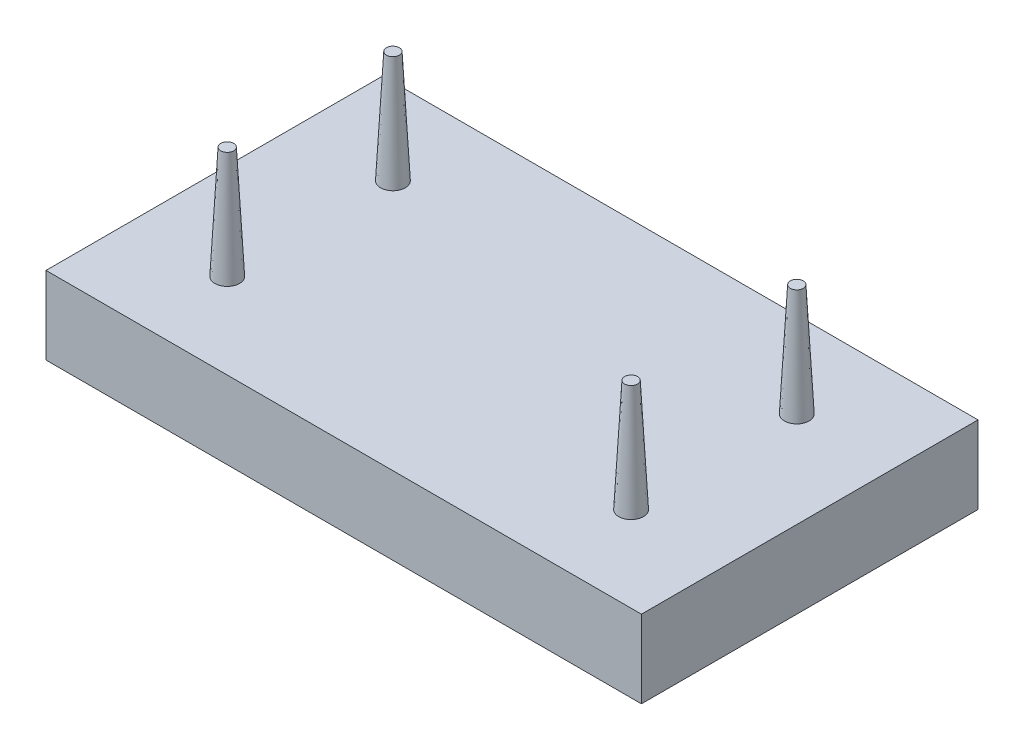
ISO-10303-21;
HEADER;
FILE_DESCRIPTION(('STEP AP214'),'2;1');
FILE_NAME('part.step','',(''),(''),'','','');
FILE_SCHEMA(('AUTOMOTIVE_DESIGN { 1 0 10303 214 1 1 1 1 }'));
ENDSEC;
DATA;
#1=APPLICATION_CONTEXT('core data for automotive mechanical design processes');
#2=APPLICATION_PROTOCOL_DEFINITION('international standard','automotive_design',2000,#1);
#3=PRODUCT_CONTEXT('',#1,'mechanical');
#4=PRODUCT('Part','Part','',(#3));
#5=PRODUCT_RELATED_PRODUCT_CATEGORY('part','',(#4));
#6=PRODUCT_DEFINITION_FORMATION('','',#4);
#7=PRODUCT_DEFINITION_CONTEXT('part definition',#1,'design');
#8=PRODUCT_DEFINITION('design','',#6,#7);
#9=PRODUCT_DEFINITION_SHAPE('','',#8);
#10=(LENGTH_UNIT() NAMED_UNIT(*) SI_UNIT(.MILLI.,.METRE.));
#11=(NAMED_UNIT(*) PLANE_ANGLE_UNIT() SI_UNIT($,.RADIAN.));
#12=(NAMED_UNIT(*) SI_UNIT($,.STERADIAN.) SOLID_ANGLE_UNIT());
#13=UNCERTAINTY_MEASURE_WITH_UNIT(LENGTH_MEASURE(1.E-05),#10,'distance_accuracy_value','');
#14=(GEOMETRIC_REPRESENTATION_CONTEXT(3) GLOBAL_UNCERTAINTY_ASSIGNED_CONTEXT((#13)) GLOBAL_UNIT_ASSIGNED_CONTEXT((#10,
#11,#12)) REPRESENTATION_CONTEXT('',''));
#15=CARTESIAN_POINT('',(0.,0.,0.));
#16=DIRECTION('',(0.,0.,1.));
#17=DIRECTION('',(1.,0.,0.));
#18=AXIS2_PLACEMENT_3D('',#15,#16,#17);
#19=CARTESIAN_POINT('',(0.,-30.,0.));
#20=DIRECTION('',(0.,1.,0.));
#21=DIRECTION('',(0.,0.,1.));
#22=AXIS2_PLACEMENT_3D('',#19,#20,#21);
#23=PLANE('',#22);
#24=DIRECTION('',(0.,0.,-1.));
#25=VECTOR('',#24,1.);
#26=CARTESIAN_POINT('',(-115.,-30.,65.));
#27=LINE('',#26,#25);
#28=CARTESIAN_POINT('',(-115.,-30.,65.));
#29=VERTEX_POINT('',#28);
#30=CARTESIAN_POINT('',(-115.,-30.,-65.));
#31=VERTEX_POINT('',#30);
#32=EDGE_CURVE('E78',#29,#31,#27,.T.);
#33=ORIENTED_EDGE('',*,*,#32,.T.);
#34=DIRECTION('',(1.,0.,0.));
#35=VECTOR('',#34,1.);
#36=CARTESIAN_POINT('',(115.,-30.,-65.));
#37=LINE('',#36,#35);
#38=CARTESIAN_POINT('',(115.,-30.,-65.));
#39=VERTEX_POINT('',#38);
#40=EDGE_CURVE('E86',#31,#39,#37,.T.);
#41=ORIENTED_EDGE('',*,*,#40,.T.);
#42=DIRECTION('',(0.,0.,1.));
#43=VECTOR('',#42,1.);
#44=CARTESIAN_POINT('',(115.,-30.,65.));
#45=LINE('',#44,#43);
#46=CARTESIAN_POINT('',(115.,-30.,65.));
#47=VERTEX_POINT('',#46);
#48=EDGE_CURVE('E92',#39,#47,#45,.T.);
#49=ORIENTED_EDGE('',*,*,#48,.T.);
#50=DIRECTION('',(-1.,0.,0.));
#51=VECTOR('',#50,1.);
#52=CARTESIAN_POINT('',(115.,-30.,65.));
#53=LINE('',#52,#51);
#54=EDGE_CURVE('E84',#47,#29,#53,.T.);
#55=ORIENTED_EDGE('',*,*,#54,.T.);
#56=EDGE_LOOP('',(#33,#41,#49,#55));
#57=FACE_BOUND('',#56,.T.);
#58=ADVANCED_FACE('F34',(#57),#23,.F.);
#59=CARTESIAN_POINT('',(115.,85.,-65.));
#60=DIRECTION('',(0.,0.,-1.));
#61=DIRECTION('',(-1.,0.,0.));
#62=AXIS2_PLACEMENT_3D('',#59,#60,#61);
#63=PLANE('',#62);
#64=DIRECTION('',(0.,-1.,0.));
#65=VECTOR('',#64,1.);
#66=CARTESIAN_POINT('',(-115.,85.,-65.));
#67=LINE('',#66,#65);
#68=CARTESIAN_POINT('',(-115.,0.,-65.));
#69=VERTEX_POINT('',#68);
#70=EDGE_CURVE('E74',#69,#31,#67,.T.);
#71=ORIENTED_EDGE('',*,*,#70,.F.);
#72=DIRECTION('',(1.,0.,0.));
#73=VECTOR('',#72,1.);
#74=CARTESIAN_POINT('',(115.,0.,-65.));
#75=LINE('',#74,#73);
#76=CARTESIAN_POINT('',(115.,0.,-65.));
#77=VERTEX_POINT('',#76);
#78=EDGE_CURVE('E38',#69,#77,#75,.T.);
#79=ORIENTED_EDGE('',*,*,#78,.T.);
#80=DIRECTION('',(0.,-1.,0.));
#81=VECTOR('',#80,1.);
#82=CARTESIAN_POINT('',(115.,85.,-65.));
#83=LINE('',#82,#81);
#84=EDGE_CURVE('E83',#77,#39,#83,.T.);
#85=ORIENTED_EDGE('',*,*,#84,.T.);
#86=ORIENTED_EDGE('',*,*,#40,.F.);
#87=EDGE_LOOP('',(#71,#79,#85,#86));
#88=FACE_BOUND('',#87,.T.);
#89=ADVANCED_FACE('F87',(#88),#63,.T.);
#90=CARTESIAN_POINT('',(115.,85.,65.));
#91=DIRECTION('',(1.,0.,0.));
#92=DIRECTION('',(0.,0.,-1.));
#93=AXIS2_PLACEMENT_3D('',#90,#91,#92);
#94=PLANE('',#93);
#95=ORIENTED_EDGE('',*,*,#84,.F.);
#96=DIRECTION('',(0.,0.,1.));
#97=VECTOR('',#96,1.);
#98=CARTESIAN_POINT('',(115.,0.,65.));
#99=LINE('',#98,#97);
#100=CARTESIAN_POINT('',(115.,0.,65.));
#101=VERTEX_POINT('',#100);
#102=EDGE_CURVE('E108',#77,#101,#99,.T.);
#103=ORIENTED_EDGE('',*,*,#102,.T.);
#104=DIRECTION('',(0.,-1.,0.));
#105=VECTOR('',#104,1.);
#106=CARTESIAN_POINT('',(115.,85.,65.));
#107=LINE('',#106,#105);
#108=EDGE_CURVE('E103',#101,#47,#107,.T.);
#109=ORIENTED_EDGE('',*,*,#108,.T.);
#110=ORIENTED_EDGE('',*,*,#48,.F.);
#111=EDGE_LOOP('',(#95,#103,#109,#110));
#112=FACE_BOUND('',#111,.T.);
#113=ADVANCED_FACE('F107',(#112),#94,.T.);
#114=CARTESIAN_POINT('',(115.,85.,65.));
#115=DIRECTION('',(0.,0.,1.));
#116=DIRECTION('',(1.,0.,0.));
#117=AXIS2_PLACEMENT_3D('',#114,#115,#116);
#118=PLANE('',#117);
#119=ORIENTED_EDGE('',*,*,#108,.F.);
#120=DIRECTION('',(-1.,0.,0.));
#121=VECTOR('',#120,1.);
#122=CARTESIAN_POINT('',(115.,0.,65.));
#123=LINE('',#122,#121);
#124=CARTESIAN_POINT('',(-115.,0.,65.));
#125=VERTEX_POINT('',#124);
#126=EDGE_CURVE('E51',#101,#125,#123,.T.);
#127=ORIENTED_EDGE('',*,*,#126,.T.);
#128=DIRECTION('',(0.,-1.,0.));
#129=VECTOR('',#128,1.);
#130=CARTESIAN_POINT('',(-115.,85.,65.));
#131=LINE('',#130,#129);
#132=EDGE_CURVE('E101',#125,#29,#131,.T.);
#133=ORIENTED_EDGE('',*,*,#132,.T.);
#134=ORIENTED_EDGE('',*,*,#54,.F.);
#135=EDGE_LOOP('',(#119,#127,#133,#134));
#136=FACE_BOUND('',#135,.T.);
#137=ADVANCED_FACE('F110',(#136),#118,.T.);
#138=CARTESIAN_POINT('',(-115.,85.,65.));
#139=DIRECTION('',(-1.,0.,0.));
#140=DIRECTION('',(0.,0.,1.));
#141=AXIS2_PLACEMENT_3D('',#138,#139,#140);
#142=PLANE('',#141);
#143=ORIENTED_EDGE('',*,*,#132,.F.);
#144=DIRECTION('',(0.,0.,-1.));
#145=VECTOR('',#144,1.);
#146=CARTESIAN_POINT('',(-115.,0.,65.));
#147=LINE('',#146,#145);
#148=EDGE_CURVE('E80',#125,#69,#147,.T.);
#149=ORIENTED_EDGE('',*,*,#148,.T.);
#150=ORIENTED_EDGE('',*,*,#70,.T.);
#151=ORIENTED_EDGE('',*,*,#32,.F.);
#152=EDGE_LOOP('',(#143,#149,#150,#151));
#153=FACE_BOUND('',#152,.T.);
#154=ADVANCED_FACE('F36',(#153),#142,.T.);
#155=CARTESIAN_POINT('',(0.,43.246,0.));
#156=DIRECTION('',(0.,-1.,0.));
#157=DIRECTION('',(0.,0.,-1.));
#158=AXIS2_PLACEMENT_3D('',#155,#156,#157);
#159=PLANE('',#158);
#160=CARTESIAN_POINT('',(-78.,43.246,-32.));
#161=DIRECTION('',(0.,-1.,0.));
#162=DIRECTION('',(-0.948683298050514,0.,0.316227766016838));
#163=AXIS2_PLACEMENT_3D('',#160,#161,#162);
#164=CIRCLE('',#163,2.5);
#165=CARTESIAN_POINT('',(-80.3717082451263,43.246,-31.2094305849579));
#166=VERTEX_POINT('',#165);
#167=EDGE_CURVE('E111',#166,#166,#164,.T.);
#168=ORIENTED_EDGE('',*,*,#167,.F.);
#169=EDGE_LOOP('',(#168));
#170=FACE_BOUND('',#169,.T.);
#171=ADVANCED_FACE('F149',(#170),#159,.F.);
#172=CARTESIAN_POINT('',(-78.,43.246,-32.));
#173=DIRECTION('',(0.,-1.,0.));
#174=DIRECTION('',(-0.948683298050514,0.,0.316227766016838));
#175=AXIS2_PLACEMENT_3D('',#172,#173,#174);
#176=CONICAL_SURFACE('',#175,2.5,0.05235987755983);
#177=ORIENTED_EDGE('',*,*,#167,.T.);
#178=EDGE_LOOP('',(#177));
#179=FACE_BOUND('',#178,.T.);
#180=CARTESIAN_POINT('',(-78.,0.,-32.));
#181=DIRECTION('',(0.,1.,0.));
#182=DIRECTION('',(0.,0.,1.));
#183=AXIS2_PLACEMENT_3D('',#180,#181,#182);
#184=CIRCLE('',#183,4.76642682287441);
#185=CARTESIAN_POINT('',(-78.,0.,-27.2335731771256));
#186=VERTEX_POINT('',#185);
#187=EDGE_CURVE('E116',#186,#186,#184,.T.);
#188=ORIENTED_EDGE('',*,*,#187,.T.);
#189=EDGE_LOOP('',(#188));
#190=FACE_BOUND('',#189,.T.);
#191=ADVANCED_FACE('F146',(#179,#190),#176,.T.);
#192=CARTESIAN_POINT('',(78.,43.246,-32.));
#193=DIRECTION('',(0.,1.,0.));
#194=DIRECTION('',(0.948683298050514,0.,-0.316227766016838));
#195=AXIS2_PLACEMENT_3D('',#192,#193,#194);
#196=PLANE('',#195);
#197=CARTESIAN_POINT('',(78.,43.246,-32.));
#198=DIRECTION('',(0.,-1.,0.));
#199=DIRECTION('',(-0.948683298050514,0.,0.316227766016838));
#200=AXIS2_PLACEMENT_3D('',#197,#198,#199);
#201=CIRCLE('',#200,2.5);
#202=CARTESIAN_POINT('',(75.6282917548737,43.246,-31.2094305849579));
#203=VERTEX_POINT('',#202);
#204=EDGE_CURVE('E117',#203,#203,#201,.T.);
#205=ORIENTED_EDGE('',*,*,#204,.F.);
#206=EDGE_LOOP('',(#205));
#207=FACE_BOUND('',#206,.T.);
#208=ADVANCED_FACE('F148',(#207),#196,.T.);
#209=CARTESIAN_POINT('',(78.,43.246,-32.));
#210=DIRECTION('',(0.,-1.,0.));
#211=DIRECTION('',(-0.948683298050514,0.,0.316227766016838));
#212=AXIS2_PLACEMENT_3D('',#209,#210,#211);
#213=CONICAL_SURFACE('',#212,2.5,0.05235987755983);
#214=ORIENTED_EDGE('',*,*,#204,.T.);
#215=EDGE_LOOP('',(#214));
#216=FACE_BOUND('',#215,.T.);
#217=CARTESIAN_POINT('',(78.,0.,-32.));
#218=DIRECTION('',(0.,1.,0.));
#219=DIRECTION('',(0.,0.,1.));
#220=AXIS2_PLACEMENT_3D('',#217,#218,#219);
#221=CIRCLE('',#220,4.76642682287441);
#222=CARTESIAN_POINT('',(78.,0.,-27.2335731771256));
#223=VERTEX_POINT('',#222);
#224=EDGE_CURVE('E120',#223,#223,#221,.T.);
#225=ORIENTED_EDGE('',*,*,#224,.T.);
#226=EDGE_LOOP('',(#225));
#227=FACE_BOUND('',#226,.T.);
#228=ADVANCED_FACE('F156',(#216,#227),#213,.T.);
#229=CARTESIAN_POINT('',(-78.,43.246,32.));
#230=DIRECTION('',(0.,1.,0.));
#231=DIRECTION('',(0.948683298050514,0.,-0.316227766016838));
#232=AXIS2_PLACEMENT_3D('',#229,#230,#231);
#233=PLANE('',#232);
#234=CARTESIAN_POINT('',(-78.,43.246,32.));
#235=DIRECTION('',(0.,-1.,0.));
#236=DIRECTION('',(-0.948683298050514,0.,0.316227766016838));
#237=AXIS2_PLACEMENT_3D('',#234,#235,#236);
#238=CIRCLE('',#237,2.5);
#239=CARTESIAN_POINT('',(-80.3717082451263,43.246,32.7905694150421));
#240=VERTEX_POINT('',#239);
#241=EDGE_CURVE('E121',#240,#240,#238,.T.);
#242=ORIENTED_EDGE('',*,*,#241,.F.);
#243=EDGE_LOOP('',(#242));
#244=FACE_BOUND('',#243,.T.);
#245=ADVANCED_FACE('F218',(#244),#233,.T.);
#246=CARTESIAN_POINT('',(-78.,43.246,32.));
#247=DIRECTION('',(0.,-1.,0.));
#248=DIRECTION('',(-0.948683298050514,0.,0.316227766016838));
#249=AXIS2_PLACEMENT_3D('',#246,#247,#248);
#250=CONICAL_SURFACE('',#249,2.5,0.05235987755983);
#251=ORIENTED_EDGE('',*,*,#241,.T.);
#252=EDGE_LOOP('',(#251));
#253=FACE_BOUND('',#252,.T.);
#254=CARTESIAN_POINT('',(-78.,0.,32.));
#255=DIRECTION('',(0.,1.,0.));
#256=DIRECTION('',(0.,0.,1.));
#257=AXIS2_PLACEMENT_3D('',#254,#255,#256);
#258=CIRCLE('',#257,4.76642682287441);
#259=CARTESIAN_POINT('',(-78.,0.,36.7664268228744));
#260=VERTEX_POINT('',#259);
#261=EDGE_CURVE('E124',#260,#260,#258,.T.);
#262=ORIENTED_EDGE('',*,*,#261,.T.);
#263=EDGE_LOOP('',(#262));
#264=FACE_BOUND('',#263,.T.);
#265=ADVANCED_FACE('F134',(#253,#264),#250,.T.);
#266=CARTESIAN_POINT('',(78.,43.246,32.));
#267=DIRECTION('',(0.,1.,0.));
#268=DIRECTION('',(0.948683298050514,0.,-0.316227766016838));
#269=AXIS2_PLACEMENT_3D('',#266,#267,#268);
#270=PLANE('',#269);
#271=CARTESIAN_POINT('',(78.,43.246,32.));
#272=DIRECTION('',(0.,-1.,0.));
#273=DIRECTION('',(-0.948683298050514,0.,0.316227766016838));
#274=AXIS2_PLACEMENT_3D('',#271,#272,#273);
#275=CIRCLE('',#274,2.5);
#276=CARTESIAN_POINT('',(75.6282917548737,43.246,32.7905694150421));
#277=VERTEX_POINT('',#276);
#278=EDGE_CURVE('E44',#277,#277,#275,.T.);
#279=ORIENTED_EDGE('',*,*,#278,.F.);
#280=EDGE_LOOP('',(#279));
#281=FACE_BOUND('',#280,.T.);
#282=ADVANCED_FACE('F243',(#281),#270,.T.);
#283=CARTESIAN_POINT('',(78.,43.246,32.));
#284=DIRECTION('',(0.,-1.,0.));
#285=DIRECTION('',(-0.948683298050514,0.,0.316227766016838));
#286=AXIS2_PLACEMENT_3D('',#283,#284,#285);
#287=CONICAL_SURFACE('',#286,2.5,0.05235987755983);
#288=ORIENTED_EDGE('',*,*,#278,.T.);
#289=EDGE_LOOP('',(#288));
#290=FACE_BOUND('',#289,.T.);
#291=CARTESIAN_POINT('',(78.,0.,32.));
#292=DIRECTION('',(0.,1.,0.));
#293=DIRECTION('',(0.,0.,1.));
#294=AXIS2_PLACEMENT_3D('',#291,#292,#293);
#295=CIRCLE('',#294,4.76642682287441);
#296=CARTESIAN_POINT('',(78.,0.,36.7664268228744));
#297=VERTEX_POINT('',#296);
#298=EDGE_CURVE('E11',#297,#297,#295,.T.);
#299=ORIENTED_EDGE('',*,*,#298,.T.);
#300=EDGE_LOOP('',(#299));
#301=FACE_BOUND('',#300,.T.);
#302=ADVANCED_FACE('F139',(#290,#301),#287,.T.);
#303=CARTESIAN_POINT('',(0.,0.,0.));
#304=DIRECTION('',(0.,1.,0.));
#305=DIRECTION('',(0.,0.,1.));
#306=AXIS2_PLACEMENT_3D('',#303,#304,#305);
#307=PLANE('',#306);
#308=ORIENTED_EDGE('',*,*,#298,.F.);
#309=EDGE_LOOP('',(#308));
#310=FACE_BOUND('',#309,.T.);
#311=ORIENTED_EDGE('',*,*,#261,.F.);
#312=EDGE_LOOP('',(#311));
#313=FACE_BOUND('',#312,.T.);
#314=ORIENTED_EDGE('',*,*,#224,.F.);
#315=EDGE_LOOP('',(#314));
#316=FACE_BOUND('',#315,.T.);
#317=ORIENTED_EDGE('',*,*,#187,.F.);
#318=EDGE_LOOP('',(#317));
#319=FACE_BOUND('',#318,.T.);
#320=ORIENTED_EDGE('',*,*,#126,.F.);
#321=ORIENTED_EDGE('',*,*,#102,.F.);
#322=ORIENTED_EDGE('',*,*,#78,.F.);
#323=ORIENTED_EDGE('',*,*,#148,.F.);
#324=EDGE_LOOP('',(#320,#321,#322,#323));
#325=FACE_BOUND('',#324,.T.);
#326=ADVANCED_FACE('F136',(#310,#313,#316,#319,#325),#307,.T.);
#327=CLOSED_SHELL('',(#58,#89,#113,#137,#154,#171,#191,#208,#228,#245,#265,#282,#302,#326));
#328=MANIFOLD_SOLID_BREP('B2',#327);
#329=ADVANCED_BREP_SHAPE_REPRESENTATION('',(#18,#328),#14);
#330=SHAPE_DEFINITION_REPRESENTATION(#9,#329);
ENDSEC;
END-ISO-10303-21;
